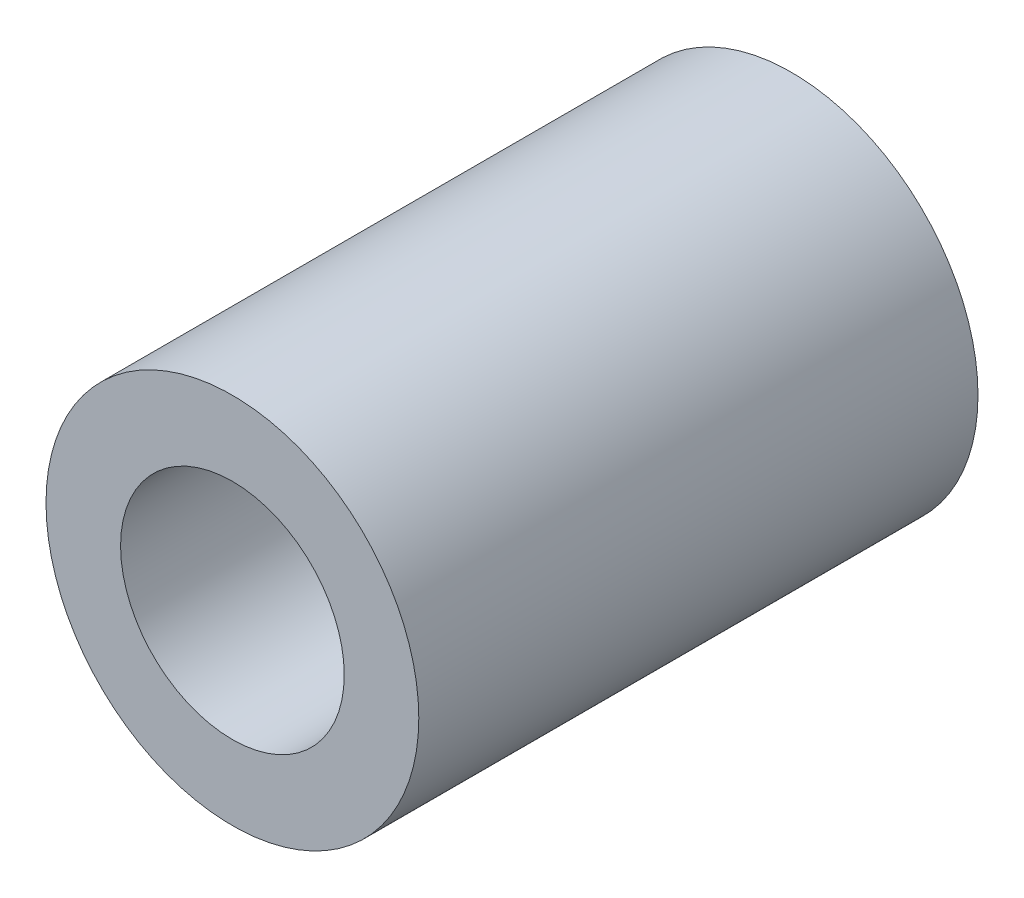
ISO-10303-21;
HEADER;
FILE_DESCRIPTION(('STEP AP214'),'2;1');
FILE_NAME('part.step','',(''),(''),'','','');
FILE_SCHEMA(('AUTOMOTIVE_DESIGN { 1 0 10303 214 1 1 1 1 }'));
ENDSEC;
DATA;
#1=APPLICATION_CONTEXT('core data for automotive mechanical design processes');
#2=APPLICATION_PROTOCOL_DEFINITION('international standard','automotive_design',2000,#1);
#3=PRODUCT_CONTEXT('',#1,'mechanical');
#4=PRODUCT('Part','Part','',(#3));
#5=PRODUCT_RELATED_PRODUCT_CATEGORY('part','',(#4));
#6=PRODUCT_DEFINITION_FORMATION('','',#4);
#7=PRODUCT_DEFINITION_CONTEXT('part definition',#1,'design');
#8=PRODUCT_DEFINITION('design','',#6,#7);
#9=PRODUCT_DEFINITION_SHAPE('','',#8);
#10=(LENGTH_UNIT() NAMED_UNIT(*) SI_UNIT(.MILLI.,.METRE.));
#11=(NAMED_UNIT(*) PLANE_ANGLE_UNIT() SI_UNIT($,.RADIAN.));
#12=(NAMED_UNIT(*) SI_UNIT($,.STERADIAN.) SOLID_ANGLE_UNIT());
#13=UNCERTAINTY_MEASURE_WITH_UNIT(LENGTH_MEASURE(1.E-05),#10,'distance_accuracy_value','');
#14=(GEOMETRIC_REPRESENTATION_CONTEXT(3) GLOBAL_UNCERTAINTY_ASSIGNED_CONTEXT((#13)) GLOBAL_UNIT_ASSIGNED_CONTEXT((#10,
#11,#12)) REPRESENTATION_CONTEXT('',''));
#15=CARTESIAN_POINT('',(0.,0.,0.));
#16=DIRECTION('',(0.,0.,1.));
#17=DIRECTION('',(1.,0.,0.));
#18=AXIS2_PLACEMENT_3D('',#15,#16,#17);
#19=CARTESIAN_POINT('',(0.,0.,6.));
#20=DIRECTION('',(0.,0.,1.));
#21=DIRECTION('',(1.,0.,0.));
#22=AXIS2_PLACEMENT_3D('',#19,#20,#21);
#23=PLANE('',#22);
#24=CARTESIAN_POINT('',(0.,0.,6.));
#25=DIRECTION('',(0.,0.,1.));
#26=DIRECTION('',(1.,0.,0.));
#27=AXIS2_PLACEMENT_3D('',#24,#25,#26);
#28=CIRCLE('',#27,2.);
#29=CARTESIAN_POINT('',(2.,0.,6.));
#30=VERTEX_POINT('',#29);
#31=EDGE_CURVE('E10',#30,#30,#28,.T.);
#32=ORIENTED_EDGE('',*,*,#31,.T.);
#33=EDGE_LOOP('',(#32));
#34=FACE_BOUND('',#33,.T.);
#35=CARTESIAN_POINT('',(0.,0.,6.));
#36=DIRECTION('',(0.,0.,1.));
#37=DIRECTION('',(1.,0.,0.));
#38=AXIS2_PLACEMENT_3D('',#35,#36,#37);
#39=CIRCLE('',#38,1.2);
#40=CARTESIAN_POINT('',(1.2,0.,6.));
#41=VERTEX_POINT('',#40);
#42=EDGE_CURVE('E44',#41,#41,#39,.T.);
#43=ORIENTED_EDGE('',*,*,#42,.F.);
#44=EDGE_LOOP('',(#43));
#45=FACE_BOUND('',#44,.T.);
#46=ADVANCED_FACE('F33',(#34,#45),#23,.T.);
#47=CARTESIAN_POINT('',(0.,0.,0.));
#48=DIRECTION('',(0.,0.,1.));
#49=DIRECTION('',(1.,0.,0.));
#50=AXIS2_PLACEMENT_3D('',#47,#48,#49);
#51=PLANE('',#50);
#52=CARTESIAN_POINT('',(0.,0.,0.));
#53=DIRECTION('',(0.,0.,1.));
#54=DIRECTION('',(1.,0.,0.));
#55=AXIS2_PLACEMENT_3D('',#52,#53,#54);
#56=CIRCLE('',#55,2.);
#57=CARTESIAN_POINT('',(2.,0.,0.));
#58=VERTEX_POINT('',#57);
#59=EDGE_CURVE('E37',#58,#58,#56,.T.);
#60=ORIENTED_EDGE('',*,*,#59,.F.);
#61=EDGE_LOOP('',(#60));
#62=FACE_BOUND('',#61,.T.);
#63=CARTESIAN_POINT('',(0.,0.,0.));
#64=DIRECTION('',(0.,0.,1.));
#65=DIRECTION('',(1.,0.,0.));
#66=AXIS2_PLACEMENT_3D('',#63,#64,#65);
#67=CIRCLE('',#66,1.2);
#68=CARTESIAN_POINT('',(1.2,0.,0.));
#69=VERTEX_POINT('',#68);
#70=EDGE_CURVE('E46',#69,#69,#67,.T.);
#71=ORIENTED_EDGE('',*,*,#70,.T.);
#72=EDGE_LOOP('',(#71));
#73=FACE_BOUND('',#72,.T.);
#74=ADVANCED_FACE('F56',(#62,#73),#51,.F.);
#75=CARTESIAN_POINT('',(0.,0.,6.));
#76=DIRECTION('',(0.,0.,-1.));
#77=DIRECTION('',(-1.,0.,0.));
#78=AXIS2_PLACEMENT_3D('',#75,#76,#77);
#79=CYLINDRICAL_SURFACE('',#78,2.);
#80=ORIENTED_EDGE('',*,*,#31,.F.);
#81=EDGE_LOOP('',(#80));
#82=FACE_BOUND('',#81,.T.);
#83=ORIENTED_EDGE('',*,*,#59,.T.);
#84=EDGE_LOOP('',(#83));
#85=FACE_BOUND('',#84,.T.);
#86=ADVANCED_FACE('F35',(#82,#85),#79,.T.);
#87=CARTESIAN_POINT('',(0.,0.,6.));
#88=DIRECTION('',(0.,0.,-1.));
#89=DIRECTION('',(-1.,0.,0.));
#90=AXIS2_PLACEMENT_3D('',#87,#88,#89);
#91=CYLINDRICAL_SURFACE('',#90,1.2);
#92=ORIENTED_EDGE('',*,*,#42,.T.);
#93=EDGE_LOOP('',(#92));
#94=FACE_BOUND('',#93,.T.);
#95=ORIENTED_EDGE('',*,*,#70,.F.);
#96=EDGE_LOOP('',(#95));
#97=FACE_BOUND('',#96,.T.);
#98=ADVANCED_FACE('F52',(#94,#97),#91,.F.);
#99=CLOSED_SHELL('',(#46,#74,#86,#98));
#100=MANIFOLD_SOLID_BREP('B2',#99);
#101=ADVANCED_BREP_SHAPE_REPRESENTATION('',(#18,#100),#14);
#102=SHAPE_DEFINITION_REPRESENTATION(#9,#101);
ENDSEC;
END-ISO-10303-21;
